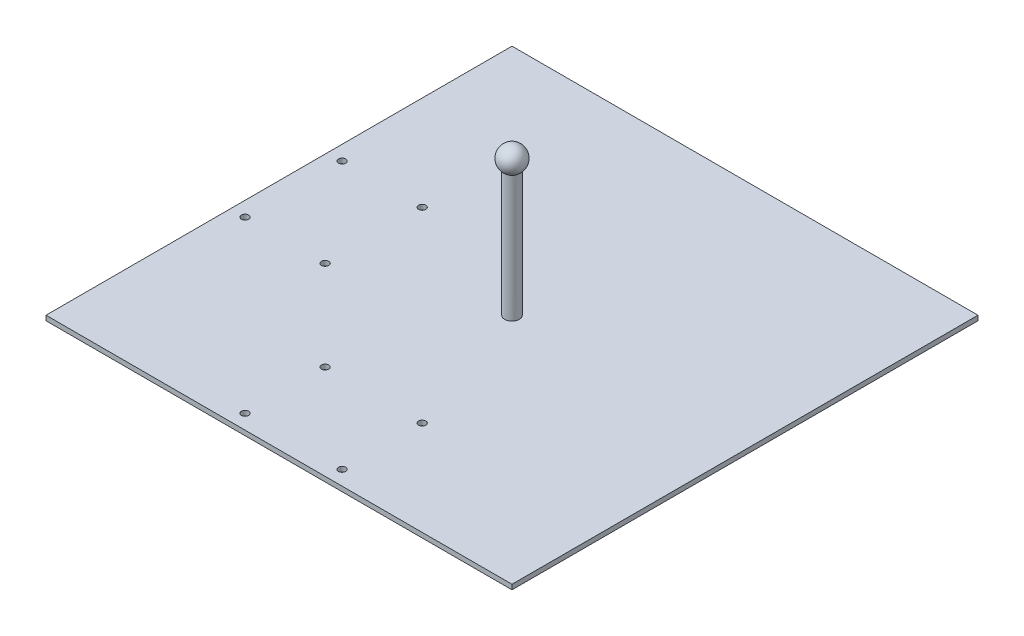
ISO-10303-21;
HEADER;
FILE_DESCRIPTION(('STEP AP214'),'2;1');
FILE_NAME('part.step','',(''),(''),'','','');
FILE_SCHEMA(('AUTOMOTIVE_DESIGN { 1 0 10303 214 1 1 1 1 }'));
ENDSEC;
DATA;
#1=APPLICATION_CONTEXT('core data for automotive mechanical design processes');
#2=APPLICATION_PROTOCOL_DEFINITION('international standard','automotive_design',2000,#1);
#3=PRODUCT_CONTEXT('',#1,'mechanical');
#4=PRODUCT('Part','Part','',(#3));
#5=PRODUCT_RELATED_PRODUCT_CATEGORY('part','',(#4));
#6=PRODUCT_DEFINITION_FORMATION('','',#4);
#7=PRODUCT_DEFINITION_CONTEXT('part definition',#1,'design');
#8=PRODUCT_DEFINITION('design','',#6,#7);
#9=PRODUCT_DEFINITION_SHAPE('','',#8);
#10=(LENGTH_UNIT() NAMED_UNIT(*) SI_UNIT(.MILLI.,.METRE.));
#11=(NAMED_UNIT(*) PLANE_ANGLE_UNIT() SI_UNIT($,.RADIAN.));
#12=(NAMED_UNIT(*) SI_UNIT($,.STERADIAN.) SOLID_ANGLE_UNIT());
#13=UNCERTAINTY_MEASURE_WITH_UNIT(LENGTH_MEASURE(1.E-05),#10,'distance_accuracy_value','');
#14=(GEOMETRIC_REPRESENTATION_CONTEXT(3) GLOBAL_UNCERTAINTY_ASSIGNED_CONTEXT((#13)) GLOBAL_UNIT_ASSIGNED_CONTEXT((#10,
#11,#12)) REPRESENTATION_CONTEXT('',''));
#15=CARTESIAN_POINT('',(0.,0.,0.));
#16=DIRECTION('',(0.,0.,1.));
#17=DIRECTION('',(1.,0.,0.));
#18=AXIS2_PLACEMENT_3D('',#15,#16,#17);
#19=CARTESIAN_POINT('',(-304.8,6.35,304.8));
#20=DIRECTION('',(0.,0.,-1.));
#21=DIRECTION('',(-1.,0.,0.));
#22=AXIS2_PLACEMENT_3D('',#19,#20,#21);
#23=PLANE('',#22);
#24=DIRECTION('',(1.,0.,0.));
#25=VECTOR('',#24,1.);
#26=CARTESIAN_POINT('',(-304.8,0.,304.8));
#27=LINE('',#26,#25);
#28=CARTESIAN_POINT('',(-304.8,0.,304.8));
#29=VERTEX_POINT('',#28);
#30=CARTESIAN_POINT('',(304.8,0.,304.8));
#31=VERTEX_POINT('',#30);
#32=EDGE_CURVE('E98',#29,#31,#27,.T.);
#33=ORIENTED_EDGE('',*,*,#32,.T.);
#34=DIRECTION('',(0.,-1.,0.));
#35=VECTOR('',#34,1.);
#36=CARTESIAN_POINT('',(304.8,6.35,304.8));
#37=LINE('',#36,#35);
#38=CARTESIAN_POINT('',(304.8,6.35,304.8));
#39=VERTEX_POINT('',#38);
#40=EDGE_CURVE('E11',#39,#31,#37,.T.);
#41=ORIENTED_EDGE('',*,*,#40,.F.);
#42=DIRECTION('',(1.,0.,0.));
#43=VECTOR('',#42,1.);
#44=CARTESIAN_POINT('',(-304.8,6.35,304.8));
#45=LINE('',#44,#43);
#46=CARTESIAN_POINT('',(-304.8,6.35,304.8));
#47=VERTEX_POINT('',#46);
#48=EDGE_CURVE('E83',#47,#39,#45,.T.);
#49=ORIENTED_EDGE('',*,*,#48,.F.);
#50=DIRECTION('',(0.,-1.,0.));
#51=VECTOR('',#50,1.);
#52=CARTESIAN_POINT('',(-304.8,6.35,304.8));
#53=LINE('',#52,#51);
#54=EDGE_CURVE('E50',#47,#29,#53,.T.);
#55=ORIENTED_EDGE('',*,*,#54,.T.);
#56=EDGE_LOOP('',(#33,#41,#49,#55));
#57=FACE_BOUND('',#56,.T.);
#58=ADVANCED_FACE('F33',(#57),#23,.F.);
#59=CARTESIAN_POINT('',(304.8,6.35,304.8));
#60=DIRECTION('',(-1.,0.,0.));
#61=DIRECTION('',(0.,0.,1.));
#62=AXIS2_PLACEMENT_3D('',#59,#60,#61);
#63=PLANE('',#62);
#64=DIRECTION('',(0.,0.,-1.));
#65=VECTOR('',#64,1.);
#66=CARTESIAN_POINT('',(304.8,0.,304.8));
#67=LINE('',#66,#65);
#68=CARTESIAN_POINT('',(304.8,0.,-304.8));
#69=VERTEX_POINT('',#68);
#70=EDGE_CURVE('E88',#31,#69,#67,.T.);
#71=ORIENTED_EDGE('',*,*,#70,.T.);
#72=DIRECTION('',(0.,-1.,0.));
#73=VECTOR('',#72,1.);
#74=CARTESIAN_POINT('',(304.8,6.35,-304.8));
#75=LINE('',#74,#73);
#76=CARTESIAN_POINT('',(304.8,6.35,-304.8));
#77=VERTEX_POINT('',#76);
#78=EDGE_CURVE('E42',#77,#69,#75,.T.);
#79=ORIENTED_EDGE('',*,*,#78,.F.);
#80=DIRECTION('',(0.,0.,-1.));
#81=VECTOR('',#80,1.);
#82=CARTESIAN_POINT('',(304.8,6.35,304.8));
#83=LINE('',#82,#81);
#84=EDGE_CURVE('E75',#39,#77,#83,.T.);
#85=ORIENTED_EDGE('',*,*,#84,.F.);
#86=ORIENTED_EDGE('',*,*,#40,.T.);
#87=EDGE_LOOP('',(#71,#79,#85,#86));
#88=FACE_BOUND('',#87,.T.);
#89=ADVANCED_FACE('F87',(#88),#63,.F.);
#90=CARTESIAN_POINT('',(-304.8,6.35,-304.8));
#91=DIRECTION('',(0.,0.,-1.));
#92=DIRECTION('',(-1.,0.,0.));
#93=AXIS2_PLACEMENT_3D('',#90,#91,#92);
#94=PLANE('',#93);
#95=DIRECTION('',(1.,0.,0.));
#96=VECTOR('',#95,1.);
#97=CARTESIAN_POINT('',(-304.8,0.,-304.8));
#98=LINE('',#97,#96);
#99=CARTESIAN_POINT('',(-304.8,0.,-304.8));
#100=VERTEX_POINT('',#99);
#101=EDGE_CURVE('E102',#100,#69,#98,.T.);
#102=ORIENTED_EDGE('',*,*,#101,.F.);
#103=DIRECTION('',(0.,-1.,0.));
#104=VECTOR('',#103,1.);
#105=CARTESIAN_POINT('',(-304.8,6.35,-304.8));
#106=LINE('',#105,#104);
#107=CARTESIAN_POINT('',(-304.8,6.35,-304.8));
#108=VERTEX_POINT('',#107);
#109=EDGE_CURVE('E64',#108,#100,#106,.T.);
#110=ORIENTED_EDGE('',*,*,#109,.F.);
#111=DIRECTION('',(1.,0.,0.));
#112=VECTOR('',#111,1.);
#113=CARTESIAN_POINT('',(-304.8,6.35,-304.8));
#114=LINE('',#113,#112);
#115=EDGE_CURVE('E82',#108,#77,#114,.T.);
#116=ORIENTED_EDGE('',*,*,#115,.T.);
#117=ORIENTED_EDGE('',*,*,#78,.T.);
#118=EDGE_LOOP('',(#102,#110,#116,#117));
#119=FACE_BOUND('',#118,.T.);
#120=ADVANCED_FACE('F92',(#119),#94,.T.);
#121=CARTESIAN_POINT('',(-304.8,6.35,304.8));
#122=DIRECTION('',(-1.,0.,0.));
#123=DIRECTION('',(0.,0.,1.));
#124=AXIS2_PLACEMENT_3D('',#121,#122,#123);
#125=PLANE('',#124);
#126=DIRECTION('',(0.,0.,-1.));
#127=VECTOR('',#126,1.);
#128=CARTESIAN_POINT('',(-304.8,0.,304.8));
#129=LINE('',#128,#127);
#130=EDGE_CURVE('E104',#29,#100,#129,.T.);
#131=ORIENTED_EDGE('',*,*,#130,.F.);
#132=ORIENTED_EDGE('',*,*,#54,.F.);
#133=DIRECTION('',(0.,0.,-1.));
#134=VECTOR('',#133,1.);
#135=CARTESIAN_POINT('',(-304.8,6.35,304.8));
#136=LINE('',#135,#134);
#137=EDGE_CURVE('E93',#47,#108,#136,.T.);
#138=ORIENTED_EDGE('',*,*,#137,.T.);
#139=ORIENTED_EDGE('',*,*,#109,.T.);
#140=EDGE_LOOP('',(#131,#132,#138,#139));
#141=FACE_BOUND('',#140,.T.);
#142=ADVANCED_FACE('F173',(#141),#125,.T.);
#143=CARTESIAN_POINT('',(0.,6.35,0.));
#144=DIRECTION('',(0.,1.,0.));
#145=DIRECTION('',(0.,0.,1.));
#146=AXIS2_PLACEMENT_3D('',#143,#144,#145);
#147=PLANE('',#146);
#148=CARTESIAN_POINT('',(0.,6.35,0.));
#149=DIRECTION('',(0.,1.,0.));
#150=DIRECTION('',(0.,0.,1.));
#151=AXIS2_PLACEMENT_3D('',#148,#149,#150);
#152=CIRCLE('',#151,9.525);
#153=CARTESIAN_POINT('',(0.,6.35,9.525));
#154=VERTEX_POINT('',#153);
#155=EDGE_CURVE('E155',#154,#154,#152,.T.);
#156=ORIENTED_EDGE('',*,*,#155,.F.);
#157=EDGE_LOOP('',(#156));
#158=FACE_BOUND('',#157,.T.);
#159=CARTESIAN_POINT('',(-63.5,6.35,285.75));
#160=DIRECTION('',(0.,1.,0.));
#161=DIRECTION('',(0.,0.,1.));
#162=AXIS2_PLACEMENT_3D('',#159,#160,#161);
#163=CIRCLE('',#162,4.7625);
#164=CARTESIAN_POINT('',(-63.5,6.35,290.5125));
#165=VERTEX_POINT('',#164);
#166=EDGE_CURVE('E151',#165,#165,#163,.T.);
#167=ORIENTED_EDGE('',*,*,#166,.F.);
#168=EDGE_LOOP('',(#167));
#169=FACE_BOUND('',#168,.T.);
#170=CARTESIAN_POINT('',(63.5,6.35,285.75));
#171=DIRECTION('',(0.,1.,0.));
#172=DIRECTION('',(0.,0.,1.));
#173=AXIS2_PLACEMENT_3D('',#170,#171,#172);
#174=CIRCLE('',#173,4.7625);
#175=CARTESIAN_POINT('',(63.5,6.35,290.5125));
#176=VERTEX_POINT('',#175);
#177=EDGE_CURVE('E145',#176,#176,#174,.T.);
#178=ORIENTED_EDGE('',*,*,#177,.F.);
#179=EDGE_LOOP('',(#178));
#180=FACE_BOUND('',#179,.T.);
#181=CARTESIAN_POINT('',(-285.75,6.35,-63.5));
#182=DIRECTION('',(0.,1.,0.));
#183=DIRECTION('',(0.,0.,1.));
#184=AXIS2_PLACEMENT_3D('',#181,#182,#183);
#185=CIRCLE('',#184,4.7625);
#186=CARTESIAN_POINT('',(-285.75,6.35,-58.7375));
#187=VERTEX_POINT('',#186);
#188=EDGE_CURVE('E139',#187,#187,#185,.T.);
#189=ORIENTED_EDGE('',*,*,#188,.F.);
#190=EDGE_LOOP('',(#189));
#191=FACE_BOUND('',#190,.T.);
#192=CARTESIAN_POINT('',(-285.75,6.35,63.5));
#193=DIRECTION('',(0.,1.,0.));
#194=DIRECTION('',(0.,0.,1.));
#195=AXIS2_PLACEMENT_3D('',#192,#193,#194);
#196=CIRCLE('',#195,4.7625);
#197=CARTESIAN_POINT('',(-285.75,6.35,68.2625));
#198=VERTEX_POINT('',#197);
#199=EDGE_CURVE('E133',#198,#198,#196,.T.);
#200=ORIENTED_EDGE('',*,*,#199,.F.);
#201=EDGE_LOOP('',(#200));
#202=FACE_BOUND('',#201,.T.);
#203=CARTESIAN_POINT('',(-63.5,6.35,180.975));
#204=DIRECTION('',(0.,1.,0.));
#205=DIRECTION('',(0.,0.,1.));
#206=AXIS2_PLACEMENT_3D('',#203,#204,#205);
#207=CIRCLE('',#206,4.7625);
#208=CARTESIAN_POINT('',(-63.5,6.35,185.7375));
#209=VERTEX_POINT('',#208);
#210=EDGE_CURVE('E127',#209,#209,#207,.T.);
#211=ORIENTED_EDGE('',*,*,#210,.F.);
#212=EDGE_LOOP('',(#211));
#213=FACE_BOUND('',#212,.T.);
#214=CARTESIAN_POINT('',(63.5,6.35,180.975));
#215=DIRECTION('',(0.,1.,0.));
#216=DIRECTION('',(0.,0.,1.));
#217=AXIS2_PLACEMENT_3D('',#214,#215,#216);
#218=CIRCLE('',#217,4.7625);
#219=CARTESIAN_POINT('',(63.5,6.35,185.7375));
#220=VERTEX_POINT('',#219);
#221=EDGE_CURVE('E124',#220,#220,#218,.T.);
#222=ORIENTED_EDGE('',*,*,#221,.F.);
#223=EDGE_LOOP('',(#222));
#224=FACE_BOUND('',#223,.T.);
#225=CARTESIAN_POINT('',(-180.975,6.35,63.5));
#226=DIRECTION('',(0.,1.,0.));
#227=DIRECTION('',(0.,0.,1.));
#228=AXIS2_PLACEMENT_3D('',#225,#226,#227);
#229=CIRCLE('',#228,4.7625);
#230=CARTESIAN_POINT('',(-180.975,6.35,68.2625));
#231=VERTEX_POINT('',#230);
#232=EDGE_CURVE('E118',#231,#231,#229,.T.);
#233=ORIENTED_EDGE('',*,*,#232,.F.);
#234=EDGE_LOOP('',(#233));
#235=FACE_BOUND('',#234,.T.);
#236=CARTESIAN_POINT('',(-180.975,6.35,-63.5));
#237=DIRECTION('',(0.,1.,0.));
#238=DIRECTION('',(0.,0.,1.));
#239=AXIS2_PLACEMENT_3D('',#236,#237,#238);
#240=CIRCLE('',#239,4.7625);
#241=CARTESIAN_POINT('',(-180.975,6.35,-58.7375));
#242=VERTEX_POINT('',#241);
#243=EDGE_CURVE('E112',#242,#242,#240,.T.);
#244=ORIENTED_EDGE('',*,*,#243,.F.);
#245=EDGE_LOOP('',(#244));
#246=FACE_BOUND('',#245,.T.);
#247=ORIENTED_EDGE('',*,*,#48,.T.);
#248=ORIENTED_EDGE('',*,*,#84,.T.);
#249=ORIENTED_EDGE('',*,*,#115,.F.);
#250=ORIENTED_EDGE('',*,*,#137,.F.);
#251=EDGE_LOOP('',(#247,#248,#249,#250));
#252=FACE_BOUND('',#251,.T.);
#253=ADVANCED_FACE('F79',(#158,#169,#180,#191,#202,#213,#224,#235,#246,#252),#147,.T.);
#254=CARTESIAN_POINT('',(0.,0.,0.));
#255=DIRECTION('',(0.,1.,0.));
#256=DIRECTION('',(0.,0.,1.));
#257=AXIS2_PLACEMENT_3D('',#254,#255,#256);
#258=PLANE('',#257);
#259=CARTESIAN_POINT('',(-63.5,0.,285.75));
#260=DIRECTION('',(0.,1.,0.));
#261=DIRECTION('',(0.,0.,1.));
#262=AXIS2_PLACEMENT_3D('',#259,#260,#261);
#263=CIRCLE('',#262,4.7625);
#264=CARTESIAN_POINT('',(-63.5,0.,290.5125));
#265=VERTEX_POINT('',#264);
#266=EDGE_CURVE('E148',#265,#265,#263,.T.);
#267=ORIENTED_EDGE('',*,*,#266,.T.);
#268=EDGE_LOOP('',(#267));
#269=FACE_BOUND('',#268,.T.);
#270=CARTESIAN_POINT('',(63.5,0.,285.75));
#271=DIRECTION('',(0.,1.,0.));
#272=DIRECTION('',(0.,0.,1.));
#273=AXIS2_PLACEMENT_3D('',#270,#271,#272);
#274=CIRCLE('',#273,4.7625);
#275=CARTESIAN_POINT('',(63.5,0.,290.5125));
#276=VERTEX_POINT('',#275);
#277=EDGE_CURVE('E142',#276,#276,#274,.T.);
#278=ORIENTED_EDGE('',*,*,#277,.T.);
#279=EDGE_LOOP('',(#278));
#280=FACE_BOUND('',#279,.T.);
#281=CARTESIAN_POINT('',(-285.75,0.,-63.5));
#282=DIRECTION('',(0.,1.,0.));
#283=DIRECTION('',(0.,0.,1.));
#284=AXIS2_PLACEMENT_3D('',#281,#282,#283);
#285=CIRCLE('',#284,4.7625);
#286=CARTESIAN_POINT('',(-285.75,0.,-58.7375));
#287=VERTEX_POINT('',#286);
#288=EDGE_CURVE('E136',#287,#287,#285,.T.);
#289=ORIENTED_EDGE('',*,*,#288,.T.);
#290=EDGE_LOOP('',(#289));
#291=FACE_BOUND('',#290,.T.);
#292=CARTESIAN_POINT('',(-285.75,0.,63.5));
#293=DIRECTION('',(0.,1.,0.));
#294=DIRECTION('',(0.,0.,1.));
#295=AXIS2_PLACEMENT_3D('',#292,#293,#294);
#296=CIRCLE('',#295,4.7625);
#297=CARTESIAN_POINT('',(-285.75,0.,68.2625));
#298=VERTEX_POINT('',#297);
#299=EDGE_CURVE('E130',#298,#298,#296,.T.);
#300=ORIENTED_EDGE('',*,*,#299,.T.);
#301=EDGE_LOOP('',(#300));
#302=FACE_BOUND('',#301,.T.);
#303=CARTESIAN_POINT('',(-63.5,0.,180.975));
#304=DIRECTION('',(0.,1.,0.));
#305=DIRECTION('',(0.,0.,1.));
#306=AXIS2_PLACEMENT_3D('',#303,#304,#305);
#307=CIRCLE('',#306,4.7625);
#308=CARTESIAN_POINT('',(-63.5,0.,185.7375));
#309=VERTEX_POINT('',#308);
#310=EDGE_CURVE('E36',#309,#309,#307,.T.);
#311=ORIENTED_EDGE('',*,*,#310,.T.);
#312=EDGE_LOOP('',(#311));
#313=FACE_BOUND('',#312,.T.);
#314=CARTESIAN_POINT('',(63.5,0.,180.975));
#315=DIRECTION('',(0.,1.,0.));
#316=DIRECTION('',(0.,0.,1.));
#317=AXIS2_PLACEMENT_3D('',#314,#315,#316);
#318=CIRCLE('',#317,4.7625);
#319=CARTESIAN_POINT('',(63.5,0.,185.7375));
#320=VERTEX_POINT('',#319);
#321=EDGE_CURVE('E121',#320,#320,#318,.T.);
#322=ORIENTED_EDGE('',*,*,#321,.T.);
#323=EDGE_LOOP('',(#322));
#324=FACE_BOUND('',#323,.T.);
#325=CARTESIAN_POINT('',(-180.975,0.,63.5));
#326=DIRECTION('',(0.,1.,0.));
#327=DIRECTION('',(0.,0.,1.));
#328=AXIS2_PLACEMENT_3D('',#325,#326,#327);
#329=CIRCLE('',#328,4.7625);
#330=CARTESIAN_POINT('',(-180.975,0.,68.2625));
#331=VERTEX_POINT('',#330);
#332=EDGE_CURVE('E115',#331,#331,#329,.T.);
#333=ORIENTED_EDGE('',*,*,#332,.T.);
#334=EDGE_LOOP('',(#333));
#335=FACE_BOUND('',#334,.T.);
#336=CARTESIAN_POINT('',(-180.975,0.,-63.5));
#337=DIRECTION('',(0.,1.,0.));
#338=DIRECTION('',(0.,0.,1.));
#339=AXIS2_PLACEMENT_3D('',#336,#337,#338);
#340=CIRCLE('',#339,4.7625);
#341=CARTESIAN_POINT('',(-180.975,0.,-58.7375));
#342=VERTEX_POINT('',#341);
#343=EDGE_CURVE('E100',#342,#342,#340,.T.);
#344=ORIENTED_EDGE('',*,*,#343,.T.);
#345=EDGE_LOOP('',(#344));
#346=FACE_BOUND('',#345,.T.);
#347=ORIENTED_EDGE('',*,*,#32,.F.);
#348=ORIENTED_EDGE('',*,*,#130,.T.);
#349=ORIENTED_EDGE('',*,*,#101,.T.);
#350=ORIENTED_EDGE('',*,*,#70,.F.);
#351=EDGE_LOOP('',(#347,#348,#349,#350));
#352=FACE_BOUND('',#351,.T.);
#353=ADVANCED_FACE('F172',(#269,#280,#291,#302,#313,#324,#335,#346,#352),#258,.F.);
#354=CARTESIAN_POINT('',(-180.975,6.35,-63.5));
#355=DIRECTION('',(0.,1.,0.));
#356=DIRECTION('',(0.,0.,1.));
#357=AXIS2_PLACEMENT_3D('',#354,#355,#356);
#358=CYLINDRICAL_SURFACE('',#357,4.7625);
#359=ORIENTED_EDGE('',*,*,#243,.T.);
#360=EDGE_LOOP('',(#359));
#361=FACE_BOUND('',#360,.T.);
#362=ORIENTED_EDGE('',*,*,#343,.F.);
#363=EDGE_LOOP('',(#362));
#364=FACE_BOUND('',#363,.T.);
#365=ADVANCED_FACE('F191',(#361,#364),#358,.F.);
#366=CARTESIAN_POINT('',(-180.975,6.35,63.5));
#367=DIRECTION('',(0.,1.,0.));
#368=DIRECTION('',(0.,0.,1.));
#369=AXIS2_PLACEMENT_3D('',#366,#367,#368);
#370=CYLINDRICAL_SURFACE('',#369,4.7625);
#371=ORIENTED_EDGE('',*,*,#232,.T.);
#372=EDGE_LOOP('',(#371));
#373=FACE_BOUND('',#372,.T.);
#374=ORIENTED_EDGE('',*,*,#332,.F.);
#375=EDGE_LOOP('',(#374));
#376=FACE_BOUND('',#375,.T.);
#377=ADVANCED_FACE('F194',(#373,#376),#370,.F.);
#378=CARTESIAN_POINT('',(63.5,6.35,180.975));
#379=DIRECTION('',(0.,1.,0.));
#380=DIRECTION('',(0.,0.,1.));
#381=AXIS2_PLACEMENT_3D('',#378,#379,#380);
#382=CYLINDRICAL_SURFACE('',#381,4.7625);
#383=ORIENTED_EDGE('',*,*,#221,.T.);
#384=EDGE_LOOP('',(#383));
#385=FACE_BOUND('',#384,.T.);
#386=ORIENTED_EDGE('',*,*,#321,.F.);
#387=EDGE_LOOP('',(#386));
#388=FACE_BOUND('',#387,.T.);
#389=ADVANCED_FACE('F244',(#385,#388),#382,.F.);
#390=CARTESIAN_POINT('',(-63.5,6.35,180.975));
#391=DIRECTION('',(0.,1.,0.));
#392=DIRECTION('',(0.,0.,1.));
#393=AXIS2_PLACEMENT_3D('',#390,#391,#392);
#394=CYLINDRICAL_SURFACE('',#393,4.7625);
#395=ORIENTED_EDGE('',*,*,#210,.T.);
#396=EDGE_LOOP('',(#395));
#397=FACE_BOUND('',#396,.T.);
#398=ORIENTED_EDGE('',*,*,#310,.F.);
#399=EDGE_LOOP('',(#398));
#400=FACE_BOUND('',#399,.T.);
#401=ADVANCED_FACE('F254',(#397,#400),#394,.F.);
#402=CARTESIAN_POINT('',(-285.75,6.35,63.5));
#403=DIRECTION('',(0.,1.,0.));
#404=DIRECTION('',(0.,0.,1.));
#405=AXIS2_PLACEMENT_3D('',#402,#403,#404);
#406=CYLINDRICAL_SURFACE('',#405,4.7625);
#407=ORIENTED_EDGE('',*,*,#199,.T.);
#408=EDGE_LOOP('',(#407));
#409=FACE_BOUND('',#408,.T.);
#410=ORIENTED_EDGE('',*,*,#299,.F.);
#411=EDGE_LOOP('',(#410));
#412=FACE_BOUND('',#411,.T.);
#413=ADVANCED_FACE('F264',(#409,#412),#406,.F.);
#414=CARTESIAN_POINT('',(-285.75,6.35,-63.5));
#415=DIRECTION('',(0.,1.,0.));
#416=DIRECTION('',(0.,0.,1.));
#417=AXIS2_PLACEMENT_3D('',#414,#415,#416);
#418=CYLINDRICAL_SURFACE('',#417,4.7625);
#419=ORIENTED_EDGE('',*,*,#188,.T.);
#420=EDGE_LOOP('',(#419));
#421=FACE_BOUND('',#420,.T.);
#422=ORIENTED_EDGE('',*,*,#288,.F.);
#423=EDGE_LOOP('',(#422));
#424=FACE_BOUND('',#423,.T.);
#425=ADVANCED_FACE('F274',(#421,#424),#418,.F.);
#426=CARTESIAN_POINT('',(63.5,6.35,285.75));
#427=DIRECTION('',(0.,1.,0.));
#428=DIRECTION('',(0.,0.,1.));
#429=AXIS2_PLACEMENT_3D('',#426,#427,#428);
#430=CYLINDRICAL_SURFACE('',#429,4.7625);
#431=ORIENTED_EDGE('',*,*,#177,.T.);
#432=EDGE_LOOP('',(#431));
#433=FACE_BOUND('',#432,.T.);
#434=ORIENTED_EDGE('',*,*,#277,.F.);
#435=EDGE_LOOP('',(#434));
#436=FACE_BOUND('',#435,.T.);
#437=ADVANCED_FACE('F284',(#433,#436),#430,.F.);
#438=CARTESIAN_POINT('',(-63.5,6.35,285.75));
#439=DIRECTION('',(0.,1.,0.));
#440=DIRECTION('',(0.,0.,1.));
#441=AXIS2_PLACEMENT_3D('',#438,#439,#440);
#442=CYLINDRICAL_SURFACE('',#441,4.7625);
#443=ORIENTED_EDGE('',*,*,#166,.T.);
#444=EDGE_LOOP('',(#443));
#445=FACE_BOUND('',#444,.T.);
#446=ORIENTED_EDGE('',*,*,#266,.F.);
#447=EDGE_LOOP('',(#446));
#448=FACE_BOUND('',#447,.T.);
#449=ADVANCED_FACE('F166',(#445,#448),#442,.F.);
#450=CARTESIAN_POINT('',(0.,171.45,0.));
#451=DIRECTION('',(0.,-1.,0.));
#452=DIRECTION('',(0.,0.,-1.));
#453=AXIS2_PLACEMENT_3D('',#450,#451,#452);
#454=CYLINDRICAL_SURFACE('',#453,9.525);
#455=CARTESIAN_POINT('',(0.,171.45,0.));
#456=DIRECTION('',(0.,1.,0.));
#457=DIRECTION('',(0.,0.,1.));
#458=AXIS2_PLACEMENT_3D('',#455,#456,#457);
#459=CIRCLE('',#458,9.525);
#460=CARTESIAN_POINT('',(0.,171.45,9.525));
#461=VERTEX_POINT('',#460);
#462=EDGE_CURVE('E154',#461,#461,#459,.T.);
#463=ORIENTED_EDGE('',*,*,#462,.F.);
#464=EDGE_LOOP('',(#463));
#465=FACE_BOUND('',#464,.T.);
#466=ORIENTED_EDGE('',*,*,#155,.T.);
#467=EDGE_LOOP('',(#466));
#468=FACE_BOUND('',#467,.T.);
#469=ADVANCED_FACE('F163',(#465,#468),#454,.T.);
#470=CARTESIAN_POINT('',(0.,184.15,0.));
#471=DIRECTION('',(0.,1.,0.));
#472=DIRECTION('',(1.,0.,0.));
#473=AXIS2_PLACEMENT_3D('',#470,#471,#472);
#474=SPHERICAL_SURFACE('',#473,15.875);
#475=ORIENTED_EDGE('',*,*,#462,.T.);
#476=EDGE_LOOP('',(#475));
#477=FACE_BOUND('',#476,.T.);
#478=ADVANCED_FACE('F161',(#477),#474,.T.);
#479=CLOSED_SHELL('',(#58,#89,#120,#142,#253,#353,#365,#377,#389,#401,#413,#425,#437,#449,#469,#478));
#480=MANIFOLD_SOLID_BREP('B2',#479);
#481=ADVANCED_BREP_SHAPE_REPRESENTATION('',(#18,#480),#14);
#482=SHAPE_DEFINITION_REPRESENTATION(#9,#481);
ENDSEC;
END-ISO-10303-21;
